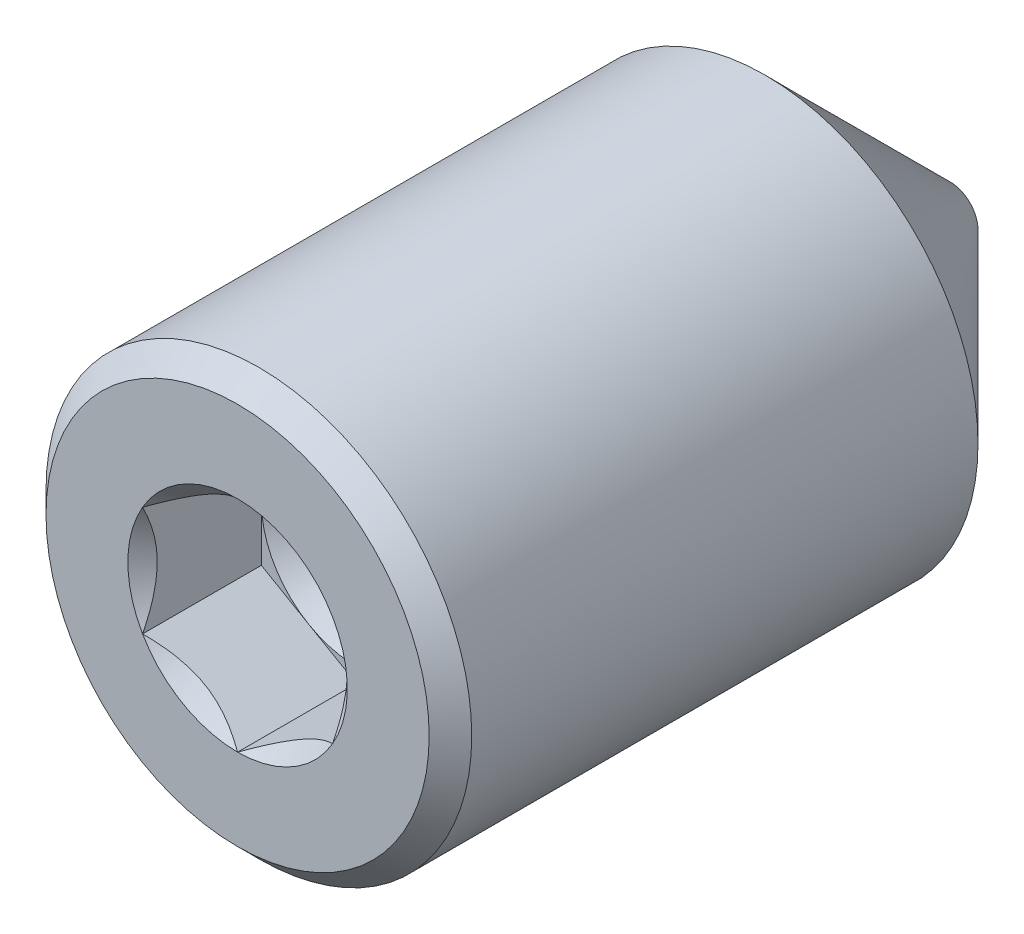
ISO-10303-21;
HEADER;
FILE_DESCRIPTION(('STEP AP214'),'2;1');
FILE_NAME('part.step','',(''),(''),'','','');
FILE_SCHEMA(('AUTOMOTIVE_DESIGN { 1 0 10303 214 1 1 1 1 }'));
ENDSEC;
DATA;
#1=APPLICATION_CONTEXT('core data for automotive mechanical design processes');
#2=APPLICATION_PROTOCOL_DEFINITION('international standard','automotive_design',2000,#1);
#3=PRODUCT_CONTEXT('',#1,'mechanical');
#4=PRODUCT('Part','Part','',(#3));
#5=PRODUCT_RELATED_PRODUCT_CATEGORY('part','',(#4));
#6=PRODUCT_DEFINITION_FORMATION('','',#4);
#7=PRODUCT_DEFINITION_CONTEXT('part definition',#1,'design');
#8=PRODUCT_DEFINITION('design','',#6,#7);
#9=PRODUCT_DEFINITION_SHAPE('','',#8);
#10=(LENGTH_UNIT() NAMED_UNIT(*) SI_UNIT(.MILLI.,.METRE.));
#11=(NAMED_UNIT(*) PLANE_ANGLE_UNIT() SI_UNIT($,.RADIAN.));
#12=(NAMED_UNIT(*) SI_UNIT($,.STERADIAN.) SOLID_ANGLE_UNIT());
#13=UNCERTAINTY_MEASURE_WITH_UNIT(LENGTH_MEASURE(1.E-05),#10,'distance_accuracy_value','');
#14=(GEOMETRIC_REPRESENTATION_CONTEXT(3) GLOBAL_UNCERTAINTY_ASSIGNED_CONTEXT((#13)) GLOBAL_UNIT_ASSIGNED_CONTEXT((#10,
#11,#12)) REPRESENTATION_CONTEXT('',''));
#15=CARTESIAN_POINT('',(0.,0.,0.));
#16=DIRECTION('',(0.,0.,1.));
#17=DIRECTION('',(1.,0.,0.));
#18=AXIS2_PLACEMENT_3D('',#15,#16,#17);
#19=CARTESIAN_POINT('',(0.,0.,1.5875));
#20=DIRECTION('',(0.,0.,1.));
#21=DIRECTION('',(1.,0.,0.));
#22=AXIS2_PLACEMENT_3D('',#19,#20,#21);
#23=PLANE('',#22);
#24=CARTESIAN_POINT('',(0.,0.,1.5875));
#25=DIRECTION('',(0.,0.,1.));
#26=DIRECTION('',(1.,0.,0.));
#27=AXIS2_PLACEMENT_3D('',#24,#25,#26);
#28=CIRCLE('',#27,0.635000000000001);
#29=CARTESIAN_POINT('',(0.634999999999999,0.,1.5875));
#30=VERTEX_POINT('',#29);
#31=CARTESIAN_POINT('',(0.317500000000001,0.54992613140312,1.5875));
#32=VERTEX_POINT('',#31);
#33=EDGE_CURVE('E128',#30,#32,#28,.T.);
#34=ORIENTED_EDGE('',*,*,#33,.F.);
#35=DIRECTION('',(0.,1.,0.));
#36=VECTOR('',#35,1.);
#37=CARTESIAN_POINT('',(0.634999999999999,-0.366617420935412,1.5875));
#38=LINE('',#37,#36);
#39=CARTESIAN_POINT('',(0.634999999999999,0.366617420935415,1.5875));
#40=VERTEX_POINT('',#39);
#41=EDGE_CURVE('E160',#30,#40,#38,.T.);
#42=ORIENTED_EDGE('',*,*,#41,.T.);
#43=DIRECTION('',(-0.866025403784439,0.5,0.));
#44=VECTOR('',#43,1.);
#45=CARTESIAN_POINT('',(0.634999999999999,0.366617420935415,1.5875));
#46=LINE('',#45,#44);
#47=EDGE_CURVE('E153',#40,#32,#46,.T.);
#48=ORIENTED_EDGE('',*,*,#47,.T.);
#49=EDGE_LOOP('',(#34,#42,#48));
#50=FACE_BOUND('',#49,.T.);
#51=ADVANCED_FACE('F43',(#50),#23,.T.);
#52=CARTESIAN_POINT('',(-0.3175,0.54992613140312,1.5875));
#53=VERTEX_POINT('',#52);
#54=EDGE_CURVE('E130',#32,#53,#28,.T.);
#55=ORIENTED_EDGE('',*,*,#54,.F.);
#56=CARTESIAN_POINT('',(0.,0.733234841870826,1.5875));
#57=VERTEX_POINT('',#56);
#58=EDGE_CURVE('E143',#32,#57,#46,.T.);
#59=ORIENTED_EDGE('',*,*,#58,.T.);
#60=DIRECTION('',(-0.86602540378444,-0.499999999999998,0.));
#61=VECTOR('',#60,1.);
#62=CARTESIAN_POINT('',(0.,0.733234841870826,1.5875));
#63=LINE('',#62,#61);
#64=EDGE_CURVE('E146',#57,#53,#63,.T.);
#65=ORIENTED_EDGE('',*,*,#64,.T.);
#66=EDGE_LOOP('',(#55,#59,#65));
#67=FACE_BOUND('',#66,.T.);
#68=ADVANCED_FACE('F142',(#67),#23,.T.);
#69=CARTESIAN_POINT('',(-0.634999999999999,0.,1.5875));
#70=VERTEX_POINT('',#69);
#71=EDGE_CURVE('E148',#53,#70,#28,.T.);
#72=ORIENTED_EDGE('',*,*,#71,.F.);
#73=CARTESIAN_POINT('',(-0.634999999999999,0.366617420935415,1.5875));
#74=VERTEX_POINT('',#73);
#75=EDGE_CURVE('E163',#53,#74,#63,.T.);
#76=ORIENTED_EDGE('',*,*,#75,.T.);
#77=DIRECTION('',(0.,-1.,0.));
#78=VECTOR('',#77,1.);
#79=CARTESIAN_POINT('',(-0.634999999999999,0.366617420935415,1.5875));
#80=LINE('',#79,#78);
#81=EDGE_CURVE('E171',#74,#70,#80,.T.);
#82=ORIENTED_EDGE('',*,*,#81,.T.);
#83=EDGE_LOOP('',(#72,#76,#82));
#84=FACE_BOUND('',#83,.T.);
#85=ADVANCED_FACE('F238',(#84),#23,.T.);
#86=CARTESIAN_POINT('',(-0.3175,-0.549926131403119,1.5875));
#87=VERTEX_POINT('',#86);
#88=EDGE_CURVE('E373',#70,#87,#28,.T.);
#89=ORIENTED_EDGE('',*,*,#88,.F.);
#90=CARTESIAN_POINT('',(-0.634999999999999,-0.366617420935413,1.5875));
#91=VERTEX_POINT('',#90);
#92=EDGE_CURVE('E170',#70,#91,#80,.T.);
#93=ORIENTED_EDGE('',*,*,#92,.T.);
#94=DIRECTION('',(0.866025403784439,-0.5,0.));
#95=VECTOR('',#94,1.);
#96=CARTESIAN_POINT('',(-0.634999999999999,-0.366617420935413,1.5875));
#97=LINE('',#96,#95);
#98=EDGE_CURVE('E262',#91,#87,#97,.T.);
#99=ORIENTED_EDGE('',*,*,#98,.T.);
#100=EDGE_LOOP('',(#89,#93,#99));
#101=FACE_BOUND('',#100,.T.);
#102=ADVANCED_FACE('F230',(#101),#23,.T.);
#103=CARTESIAN_POINT('',(0.3175,-0.549926131403118,1.5875));
#104=VERTEX_POINT('',#103);
#105=EDGE_CURVE('E65',#87,#104,#28,.T.);
#106=ORIENTED_EDGE('',*,*,#105,.F.);
#107=CARTESIAN_POINT('',(0.,-0.733234841870825,1.5875));
#108=VERTEX_POINT('',#107);
#109=EDGE_CURVE('E264',#87,#108,#97,.T.);
#110=ORIENTED_EDGE('',*,*,#109,.T.);
#111=DIRECTION('',(0.866025403784438,0.5,0.));
#112=VECTOR('',#111,1.);
#113=CARTESIAN_POINT('',(0.,-0.733234841870825,1.5875));
#114=LINE('',#113,#112);
#115=EDGE_CURVE('E260',#108,#104,#114,.T.);
#116=ORIENTED_EDGE('',*,*,#115,.T.);
#117=EDGE_LOOP('',(#106,#110,#116));
#118=FACE_BOUND('',#117,.T.);
#119=ADVANCED_FACE('F221',(#118),#23,.T.);
#120=CARTESIAN_POINT('',(0.,1.4224,2.38125));
#121=DIRECTION('',(0.,0.,-1.));
#122=DIRECTION('',(-1.,0.,0.));
#123=AXIS2_PLACEMENT_3D('',#120,#121,#122);
#124=PLANE('',#123);
#125=CARTESIAN_POINT('',(0.,0.,2.38125));
#126=DIRECTION('',(0.,0.,1.));
#127=DIRECTION('',(1.,0.,0.));
#128=AXIS2_PLACEMENT_3D('',#125,#126,#127);
#129=CIRCLE('',#128,0.733234841870826);
#130=CARTESIAN_POINT('',(-0.634999999999999,0.366617420935415,2.38125));
#131=VERTEX_POINT('',#130);
#132=CARTESIAN_POINT('',(-0.634999999999999,-0.366617420935416,2.38125));
#133=VERTEX_POINT('',#132);
#134=EDGE_CURVE('E72',#131,#133,#129,.T.);
#135=ORIENTED_EDGE('',*,*,#134,.F.);
#136=CARTESIAN_POINT('',(0.,0.733234841870826,2.38125));
#137=VERTEX_POINT('',#136);
#138=EDGE_CURVE('E347',#137,#131,#129,.T.);
#139=ORIENTED_EDGE('',*,*,#138,.F.);
#140=CARTESIAN_POINT('',(0.634999999999999,0.366617420935416,2.38125));
#141=VERTEX_POINT('',#140);
#142=EDGE_CURVE('E340',#141,#137,#129,.T.);
#143=ORIENTED_EDGE('',*,*,#142,.F.);
#144=CARTESIAN_POINT('',(0.635000000000002,-0.366617420935411,2.38125));
#145=VERTEX_POINT('',#144);
#146=EDGE_CURVE('E137',#145,#141,#129,.T.);
#147=ORIENTED_EDGE('',*,*,#146,.F.);
#148=CARTESIAN_POINT('',(0.,-0.733234841870826,2.38125));
#149=VERTEX_POINT('',#148);
#150=EDGE_CURVE('E338',#149,#145,#129,.T.);
#151=ORIENTED_EDGE('',*,*,#150,.F.);
#152=EDGE_CURVE('E345',#133,#149,#129,.T.);
#153=ORIENTED_EDGE('',*,*,#152,.F.);
#154=EDGE_LOOP('',(#135,#139,#143,#147,#151,#153));
#155=FACE_BOUND('',#154,.T.);
#156=CARTESIAN_POINT('',(0.,0.,2.38125));
#157=DIRECTION('',(0.,0.,-1.));
#158=DIRECTION('',(-1.,0.,0.));
#159=AXIS2_PLACEMENT_3D('',#156,#157,#158);
#160=CIRCLE('',#159,1.28016);
#161=CARTESIAN_POINT('',(-1.28016,0.,2.38125));
#162=VERTEX_POINT('',#161);
#163=EDGE_CURVE('E203',#162,#162,#160,.F.);
#164=ORIENTED_EDGE('',*,*,#163,.T.);
#165=EDGE_LOOP('',(#164));
#166=FACE_BOUND('',#165,.T.);
#167=ADVANCED_FACE('F218',(#155,#166),#124,.F.);
#168=CARTESIAN_POINT('',(0.,0.,-2.38125));
#169=DIRECTION('',(0.,0.,1.));
#170=DIRECTION('',(1.,0.,0.));
#171=AXIS2_PLACEMENT_3D('',#168,#169,#170);
#172=PLANE('',#171);
#173=CARTESIAN_POINT('',(0.,0.,-2.38125));
#174=DIRECTION('',(0.,0.,1.));
#175=DIRECTION('',(1.,0.,0.));
#176=AXIS2_PLACEMENT_3D('',#173,#174,#175);
#177=CIRCLE('',#176,0.184912);
#178=CARTESIAN_POINT('',(0.184912,0.,-2.38125));
#179=VERTEX_POINT('',#178);
#180=EDGE_CURVE('E199',#179,#179,#177,.T.);
#181=ORIENTED_EDGE('',*,*,#180,.F.);
#182=EDGE_LOOP('',(#181));
#183=FACE_BOUND('',#182,.T.);
#184=ADVANCED_FACE('F220',(#183),#172,.F.);
#185=CARTESIAN_POINT('',(0.,0.,-2.38125));
#186=DIRECTION('',(0.,0.,1.));
#187=DIRECTION('',(1.,0.,0.));
#188=AXIS2_PLACEMENT_3D('',#185,#186,#187);
#189=CONICAL_SURFACE('',#188,0.184912,0.78539816339745);
#190=CARTESIAN_POINT('',(0.,0.,-1.143762));
#191=DIRECTION('',(0.,0.,1.));
#192=DIRECTION('',(1.,0.,0.));
#193=AXIS2_PLACEMENT_3D('',#190,#191,#192);
#194=CIRCLE('',#193,1.4224);
#195=CARTESIAN_POINT('',(1.4224,0.,-1.143762));
#196=VERTEX_POINT('',#195);
#197=EDGE_CURVE('E180',#196,#196,#194,.T.);
#198=CARTESIAN_POINT('',(1.4224,0.,-1.143762));
#199=CARTESIAN_POINT('',(1.4095095,0.,-1.1566525));
#200=CARTESIAN_POINT('',(1.396619,0.,-1.169543));
#201=CARTESIAN_POINT('',(1.370838,0.,-1.195324));
#202=CARTESIAN_POINT('',(1.3579475,0.,-1.2082145));
#203=CARTESIAN_POINT('',(1.3321665,0.,-1.2339955));
#204=CARTESIAN_POINT('',(1.319276,0.,-1.246886));
#205=CARTESIAN_POINT('',(1.293495,0.,-1.272667));
#206=CARTESIAN_POINT('',(1.2806045,0.,-1.2855575));
#207=CARTESIAN_POINT('',(1.2548235,0.,-1.3113385));
#208=CARTESIAN_POINT('',(1.241933,0.,-1.324229));
#209=CARTESIAN_POINT('',(1.216152,0.,-1.35001));
#210=CARTESIAN_POINT('',(1.2032615,0.,-1.3629005));
#211=CARTESIAN_POINT('',(1.1774805,0.,-1.3886815));
#212=CARTESIAN_POINT('',(1.16459,0.,-1.401572));
#213=CARTESIAN_POINT('',(1.138809,0.,-1.427353));
#214=CARTESIAN_POINT('',(1.1259185,0.,-1.4402435));
#215=CARTESIAN_POINT('',(1.1001375,0.,-1.4660245));
#216=CARTESIAN_POINT('',(1.087247,0.,-1.478915));
#217=CARTESIAN_POINT('',(1.061466,0.,-1.504696));
#218=CARTESIAN_POINT('',(1.0485755,0.,-1.5175865));
#219=CARTESIAN_POINT('',(1.0227945,0.,-1.5433675));
#220=CARTESIAN_POINT('',(1.009904,0.,-1.556258));
#221=CARTESIAN_POINT('',(0.984122999999999,0.,-1.582039));
#222=CARTESIAN_POINT('',(0.971232499999999,0.,-1.5949295));
#223=CARTESIAN_POINT('',(0.945451499999999,0.,-1.6207105));
#224=CARTESIAN_POINT('',(0.932560999999999,0.,-1.633601));
#225=CARTESIAN_POINT('',(0.906779999999999,0.,-1.659382));
#226=CARTESIAN_POINT('',(0.893889499999999,0.,-1.6722725));
#227=CARTESIAN_POINT('',(0.868108499999999,0.,-1.6980535));
#228=CARTESIAN_POINT('',(0.855217999999999,0.,-1.710944));
#229=CARTESIAN_POINT('',(0.829436999999999,0.,-1.736725));
#230=CARTESIAN_POINT('',(0.816546499999999,0.,-1.7496155));
#231=CARTESIAN_POINT('',(0.790765499999999,0.,-1.7753965));
#232=CARTESIAN_POINT('',(0.777874999999999,0.,-1.788287));
#233=CARTESIAN_POINT('',(0.752093999999999,0.,-1.814068));
#234=CARTESIAN_POINT('',(0.739203499999999,0.,-1.8269585));
#235=CARTESIAN_POINT('',(0.713422499999999,0.,-1.8527395));
#236=CARTESIAN_POINT('',(0.700531999999999,0.,-1.86563));
#237=CARTESIAN_POINT('',(0.674750999999999,0.,-1.891411));
#238=CARTESIAN_POINT('',(0.661860499999999,0.,-1.9043015));
#239=CARTESIAN_POINT('',(0.636079499999999,0.,-1.9300825));
#240=CARTESIAN_POINT('',(0.623188999999999,0.,-1.942973));
#241=CARTESIAN_POINT('',(0.597407999999999,0.,-1.968754));
#242=CARTESIAN_POINT('',(0.584517499999999,0.,-1.9816445));
#243=CARTESIAN_POINT('',(0.5587365,0.,-2.0074255));
#244=CARTESIAN_POINT('',(0.545846,0.,-2.020316));
#245=CARTESIAN_POINT('',(0.520064999999999,0.,-2.046097));
#246=CARTESIAN_POINT('',(0.507174499999999,0.,-2.0589875));
#247=CARTESIAN_POINT('',(0.481393499999999,0.,-2.0847685));
#248=CARTESIAN_POINT('',(0.468502999999999,0.,-2.097659));
#249=CARTESIAN_POINT('',(0.442722,0.,-2.12344));
#250=CARTESIAN_POINT('',(0.429831499999999,0.,-2.1363305));
#251=CARTESIAN_POINT('',(0.404050499999999,0.,-2.1621115));
#252=CARTESIAN_POINT('',(0.39116,0.,-2.175002));
#253=CARTESIAN_POINT('',(0.365379,0.,-2.200783));
#254=CARTESIAN_POINT('',(0.352488499999999,0.,-2.2136735));
#255=CARTESIAN_POINT('',(0.326707499999999,0.,-2.2394545));
#256=CARTESIAN_POINT('',(0.313817,0.,-2.252345));
#257=CARTESIAN_POINT('',(0.288036,0.,-2.278126));
#258=CARTESIAN_POINT('',(0.2751455,0.,-2.2910165));
#259=CARTESIAN_POINT('',(0.2493645,0.,-2.3167975));
#260=CARTESIAN_POINT('',(0.236474,0.,-2.329688));
#261=CARTESIAN_POINT('',(0.210693,0.,-2.355469));
#262=CARTESIAN_POINT('',(0.1978025,0.,-2.3683595));
#263=CARTESIAN_POINT('',(0.184912,0.,-2.38125));
#264=B_SPLINE_CURVE_WITH_KNOTS('',3,(#198,#199,#200,#201,#202,#203,#204,#205,#206,#207,#208,
#209,#210,#211,#212,#213,#214,#215,#216,#217,#218,#219,#220,#221,#222,#223,#224,#225,#226,#227,
#228,#229,#230,#231,#232,#233,#234,#235,#236,#237,#238,#239,#240,#241,#242,#243,#244,#245,#246,
#247,#248,#249,#250,#251,#252,#253,#254,#255,#256,#257,#258,#259,#260,#261,#262,#263),
.UNSPECIFIED.,.F.,.F.,(4,2,2,2,2,2,2,2,2,2,2,2,2,2,2,2,2,2,2,2,2,2,2,2,2,2,2,2,2,2,2,2,4),(0.,
0.0546897597773109,0.109379519554622,0.164069279331933,0.218759039109244,0.273448798886555,
0.328138558663866,0.382828318441177,0.437518078218488,0.492207837995799,0.54689759777311,
0.601587357550421,0.656277117327732,0.710966877105043,0.765656636882354,0.820346396659665,
0.875036156436976,0.929725916214287,0.984415675991598,1.03910543576891,1.09379519554622,
1.14848495532353,1.20317471510084,1.25786447487815,1.31255423465546,1.36724399443278,
1.42193375421009,1.4766235139874,1.53131327376471,1.58600303354202,1.64069279331933,
1.69538255309664,1.75007231287395),.UNSPECIFIED.);
#265=EDGE_CURVE('BSEAM227',#196,#179,#264,.T.);
#266=ORIENTED_EDGE('',*,*,#197,.F.);
#267=ORIENTED_EDGE('',*,*,#180,.T.);
#268=ORIENTED_EDGE('',*,*,#265,.T.);
#269=ORIENTED_EDGE('',*,*,#265,.F.);
#270=EDGE_LOOP('',(#266,#268,#267,#269));
#271=FACE_BOUND('',#270,.T.);
#272=ADVANCED_FACE('F227',(#271),#189,.T.);
#273=CARTESIAN_POINT('',(0.,0.,2.38125));
#274=DIRECTION('',(0.,0.,1.));
#275=DIRECTION('',(1.,0.,0.));
#276=AXIS2_PLACEMENT_3D('',#273,#274,#275);
#277=CYLINDRICAL_SURFACE('',#276,1.4224);
#278=CARTESIAN_POINT('',(0.,0.,2.23901));
#279=DIRECTION('',(0.,0.,-1.));
#280=DIRECTION('',(-1.,0.,0.));
#281=AXIS2_PLACEMENT_3D('',#278,#279,#280);
#282=CIRCLE('',#281,1.4224);
#283=CARTESIAN_POINT('',(-1.4224,0.,2.23901));
#284=VERTEX_POINT('',#283);
#285=EDGE_CURVE('E58',#284,#284,#282,.T.);
#286=ORIENTED_EDGE('',*,*,#285,.T.);
#287=EDGE_LOOP('',(#286));
#288=FACE_BOUND('',#287,.T.);
#289=ORIENTED_EDGE('',*,*,#197,.T.);
#290=EDGE_LOOP('',(#289));
#291=FACE_BOUND('',#290,.T.);
#292=ADVANCED_FACE('F210',(#288,#291),#277,.T.);
#293=CARTESIAN_POINT('',(0.,0.,2.38125));
#294=DIRECTION('',(0.,0.,-1.));
#295=DIRECTION('',(-1.,0.,0.));
#296=AXIS2_PLACEMENT_3D('',#293,#294,#295);
#297=CONICAL_SURFACE('',#296,1.28016,0.785398163397448);
#298=ORIENTED_EDGE('',*,*,#285,.F.);
#299=EDGE_LOOP('',(#298));
#300=FACE_BOUND('',#299,.T.);
#301=ORIENTED_EDGE('',*,*,#163,.F.);
#302=EDGE_LOOP('',(#301));
#303=FACE_BOUND('',#302,.T.);
#304=ADVANCED_FACE('F45',(#300,#303),#297,.T.);
#305=CARTESIAN_POINT('',(0.,0.,2.38125));
#306=DIRECTION('',(0.,0.,1.));
#307=DIRECTION('',(1.,0.,0.));
#308=AXIS2_PLACEMENT_3D('',#305,#306,#307);
#309=CONICAL_SURFACE('',#308,0.733234841870826,0.78539816339745);
#310=ORIENTED_EDGE('',*,*,#150,.T.);
#311=CARTESIAN_POINT('',(-0.000200000000000102,-0.733350311924663,2.38136549732593));
#312=CARTESIAN_POINT('',(0.0216382953156779,-0.720741966245514,2.36876471523145));
#313=CARTESIAN_POINT('',(0.0438403745570412,-0.707923589818943,2.35690242075504));
#314=CARTESIAN_POINT('',(0.0891134104790393,-0.681785190342346,2.33518202089685));
#315=CARTESIAN_POINT('',(0.112188680945241,-0.668462676727061,2.32533601315109));
#316=CARTESIAN_POINT('',(0.158721911288256,-0.641596703662258,2.30847150279478));
#317=CARTESIAN_POINT('',(0.182167952487112,-0.628060125464668,2.30141053144256));
#318=CARTESIAN_POINT('',(0.229565059822435,-0.60069539278581,2.29052263650265));
#319=CARTESIAN_POINT('',(0.253514703467398,-0.586868059580394,2.28668760314623));
#320=CARTESIAN_POINT('',(0.312013188787161,-0.553093943333844,2.28182213495313));
#321=CARTESIAN_POINT('',(0.346698667719925,-0.533068272735041,2.28270233088706));
#322=CARTESIAN_POINT('',(0.415342587019972,-0.493436687448928,2.29177206408745));
#323=CARTESIAN_POINT('',(0.449299864102858,-0.473831444384177,2.29997251663846));
#324=CARTESIAN_POINT('',(0.508936458936855,-0.439400240303216,2.31974854218865));
#325=CARTESIAN_POINT('',(0.534889912662094,-0.424416006808549,2.33029263333793));
#326=CARTESIAN_POINT('',(0.585779870462626,-0.395034675973363,2.35404604870667));
#327=CARTESIAN_POINT('',(0.610719373212326,-0.380635847347369,2.36724670343896));
#328=CARTESIAN_POINT('',(0.635199999999999,-0.366501950881575,2.38136549732593));
#329=B_SPLINE_CURVE_WITH_KNOTS('',3,(#311,#312,#313,#314,#315,#316,#317,#318,#319,#320,#321,
#322,#323,#324,#325,#326,#327,#328),.UNSPECIFIED.,.F.,.F.,(4,2,2,2,2,2,2,2,4),(0.,
0.0846259124083199,0.169745589939071,0.253511844988299,0.337066883146092,0.456489711576423,
0.576090910203463,0.671263448299218,0.76613029304668),.UNSPECIFIED.);
#330=EDGE_CURVE('E11',#149,#145,#329,.T.);
#331=ORIENTED_EDGE('',*,*,#330,.F.);
#332=EDGE_LOOP('',(#310,#331));
#333=FACE_BOUND('',#332,.T.);
#334=ADVANCED_FACE('F215',(#333),#309,.F.);
#335=ORIENTED_EDGE('',*,*,#146,.T.);
#336=CARTESIAN_POINT('',(0.634999999999999,-0.731184774905032,2.6164449052213));
#337=CARTESIAN_POINT('',(0.634999999999999,-0.695560510635467,2.58960843318131));
#338=CARTESIAN_POINT('',(0.634999999999999,-0.65955949454243,2.56321676788828));
#339=CARTESIAN_POINT('',(0.634999999999999,-0.58618430998853,2.51179559409201));
#340=CARTESIAN_POINT('',(0.634999999999999,-0.548801623395418,2.48677831137227));
#341=CARTESIAN_POINT('',(0.634999999999999,-0.470413352958487,2.43765509006025));
#342=CARTESIAN_POINT('',(0.634999999999999,-0.429322770893479,2.41368267599417));
#343=CARTESIAN_POINT('',(0.634999999999999,-0.345090964349352,2.3698343213979));
#344=CARTESIAN_POINT('',(0.634999999999999,-0.301957281434777,2.34994457081665));
#345=CARTESIAN_POINT('',(0.634999999999999,-0.237206748479471,2.32561298918661));
#346=CARTESIAN_POINT('',(0.634999999999999,-0.216551949441191,2.31862994139745));
#347=CARTESIAN_POINT('',(0.634999999999999,-0.174754779429724,2.30631758646518));
#348=CARTESIAN_POINT('',(0.634999999999999,-0.153612374975028,2.30098839324967));
#349=CARTESIAN_POINT('',(0.634999999999999,-0.0903392283049218,2.28811090149537));
#350=CARTESIAN_POINT('',(0.634999999999999,-0.0475748058684262,2.28335601608245));
#351=CARTESIAN_POINT('',(0.634999999999999,0.0364716243291507,2.28272192409468));
#352=CARTESIAN_POINT('',(0.634999999999999,0.077751297067312,2.28652786995088));
#353=CARTESIAN_POINT('',(0.634999999999999,0.138948326892628,2.2977155796225));
#354=CARTESIAN_POINT('',(0.634999999999999,0.159409283049329,2.30242653583126));
#355=CARTESIAN_POINT('',(0.634999999999999,0.199893323210749,2.31345163610963));
#356=CARTESIAN_POINT('',(0.634999999999999,0.21991644370174,2.31976564603429));
#357=CARTESIAN_POINT('',(0.634999999999999,0.282954568585315,2.3420207669286));
#358=CARTESIAN_POINT('',(0.634999999999999,0.32506940210101,2.36049746255418));
#359=CARTESIAN_POINT('',(0.634999999999999,0.407322059089851,2.4015810215375));
#360=CARTESIAN_POINT('',(0.634999999999999,0.447452099887751,2.42420272349413));
#361=CARTESIAN_POINT('',(0.634999999999999,0.52414778940185,2.47085987110921));
#362=CARTESIAN_POINT('',(0.634999999999999,0.560791466616129,2.49476920217037));
#363=CARTESIAN_POINT('',(0.634999999999999,0.632664852451176,2.54402829933761));
#364=CARTESIAN_POINT('',(0.634999999999999,0.667903672431243,2.56936468957093));
#365=CARTESIAN_POINT('',(0.634999999999999,0.702755676949191,2.59516379561133));
#366=B_SPLINE_CURVE_WITH_KNOTS('',3,(#336,#337,#338,#339,#340,#341,#342,#343,#344,#345,#346,
#347,#348,#349,#350,#351,#352,#353,#354,#355,#356,#357,#358,#359,#360,#361,#362,#363,#364,#365),
.UNSPECIFIED.,.F.,.F.,(4,2,2,2,2,2,2,2,2,2,2,2,2,2,4),(0.,0.13385216777859,0.268748027168033,
0.411343582300861,0.553448541187978,0.618797785929163,0.684151531326689,0.812345657019689,
0.93590247627937,0.998834470169292,1.06176119958964,1.19932956824188,1.33740039345849,
1.46861008284853,1.59874695816139),.UNSPECIFIED.);
#367=EDGE_CURVE('E295',#145,#141,#366,.T.);
#368=ORIENTED_EDGE('',*,*,#367,.F.);
#369=EDGE_LOOP('',(#335,#368));
#370=FACE_BOUND('',#369,.T.);
#371=ADVANCED_FACE('F430',(#370),#309,.F.);
#372=ORIENTED_EDGE('',*,*,#142,.T.);
#373=CARTESIAN_POINT('',(0.635199999999999,0.366501950881577,2.38136549732593));
#374=CARTESIAN_POINT('',(0.613361704684321,0.379110296560726,2.36876471523145));
#375=CARTESIAN_POINT('',(0.591159625442958,0.391928672987296,2.35690242075504));
#376=CARTESIAN_POINT('',(0.54588658952096,0.418067072463893,2.33518202089685));
#377=CARTESIAN_POINT('',(0.522811319054759,0.431389586079178,2.32533601315109));
#378=CARTESIAN_POINT('',(0.476278088711744,0.458255559143981,2.30847150279478));
#379=CARTESIAN_POINT('',(0.452832047512888,0.471792137341571,2.30141053144256));
#380=CARTESIAN_POINT('',(0.405434940177565,0.499156870020429,2.29052263650265));
#381=CARTESIAN_POINT('',(0.381485296532602,0.512984203225845,2.28668760314623));
#382=CARTESIAN_POINT('',(0.322986811212839,0.546758319472395,2.28182213495313));
#383=CARTESIAN_POINT('',(0.288301332280075,0.566783990071197,2.28270233088706));
#384=CARTESIAN_POINT('',(0.219657412980027,0.606415575357311,2.29177206408745));
#385=CARTESIAN_POINT('',(0.185700135897142,0.626020818422061,2.29997251663846));
#386=CARTESIAN_POINT('',(0.126063541063145,0.660452022503022,2.31974854218865));
#387=CARTESIAN_POINT('',(0.100110087337906,0.67543625599769,2.33029263333793));
#388=CARTESIAN_POINT('',(0.0492201295373734,0.704817586832876,2.35404604870667));
#389=CARTESIAN_POINT('',(0.024280626787674,0.71921641545887,2.36724670343896));
#390=CARTESIAN_POINT('',(-0.000199999999999248,0.733350311924664,2.38136549732593));
#391=B_SPLINE_CURVE_WITH_KNOTS('',3,(#373,#374,#375,#376,#377,#378,#379,#380,#381,#382,#383,
#384,#385,#386,#387,#388,#389,#390),.UNSPECIFIED.,.F.,.F.,(4,2,2,2,2,2,2,2,4),(0.,
0.0846259124083197,0.169745589939071,0.253511844988298,0.337066883146091,0.456489711576421,
0.576090910203462,0.671263448299217,0.766130293046679),.UNSPECIFIED.);
#392=EDGE_CURVE('E304',#141,#137,#391,.T.);
#393=ORIENTED_EDGE('',*,*,#392,.F.);
#394=EDGE_LOOP('',(#372,#393));
#395=FACE_BOUND('',#394,.T.);
#396=ADVANCED_FACE('F421',(#395),#309,.F.);
#397=ORIENTED_EDGE('',*,*,#138,.T.);
#398=CARTESIAN_POINT('',(0.000200000000000754,0.733350311924664,2.38136549732593));
#399=CARTESIAN_POINT('',(-0.0216382953156771,0.720741966245515,2.36876471523145));
#400=CARTESIAN_POINT('',(-0.0438403745570405,0.707923589818944,2.35690242075504));
#401=CARTESIAN_POINT('',(-0.0891134104790388,0.681785190342347,2.33518202089685));
#402=CARTESIAN_POINT('',(-0.11218868094524,0.668462676727062,2.32533601315109));
#403=CARTESIAN_POINT('',(-0.158721911288255,0.64159670366226,2.30847150279478));
#404=CARTESIAN_POINT('',(-0.182167952487111,0.628060125464669,2.30141053144256));
#405=CARTESIAN_POINT('',(-0.229565059822434,0.600695392785811,2.29052263650265));
#406=CARTESIAN_POINT('',(-0.253514703467398,0.586868059580396,2.28668760314623));
#407=CARTESIAN_POINT('',(-0.31201318878716,0.553093943333846,2.28182213495313));
#408=CARTESIAN_POINT('',(-0.346698667719925,0.533068272735043,2.28270233088706));
#409=CARTESIAN_POINT('',(-0.415342587019972,0.49343668744893,2.29177206408745));
#410=CARTESIAN_POINT('',(-0.449299864102858,0.473831444384179,2.29997251663846));
#411=CARTESIAN_POINT('',(-0.508936458936855,0.439400240303218,2.31974854218865));
#412=CARTESIAN_POINT('',(-0.534889912662094,0.424416006808551,2.33029263333793));
#413=CARTESIAN_POINT('',(-0.585779870462627,0.395034675973365,2.35404604870667));
#414=CARTESIAN_POINT('',(-0.610719373212326,0.380635847347371,2.36724670343896));
#415=CARTESIAN_POINT('',(-0.635199999999999,0.366501950881577,2.38136549732593));
#416=B_SPLINE_CURVE_WITH_KNOTS('',3,(#398,#399,#400,#401,#402,#403,#404,#405,#406,#407,#408,
#409,#410,#411,#412,#413,#414,#415),.UNSPECIFIED.,.F.,.F.,(4,2,2,2,2,2,2,2,4),(0.,
0.08462591240832,0.169745589939071,0.253511844988299,0.337066883146092,0.456489711576422,
0.576090910203463,0.671263448299218,0.76613029304668),.UNSPECIFIED.);
#417=EDGE_CURVE('E310',#137,#131,#416,.T.);
#418=ORIENTED_EDGE('',*,*,#417,.F.);
#419=EDGE_LOOP('',(#397,#418));
#420=FACE_BOUND('',#419,.T.);
#421=ADVANCED_FACE('F412',(#420),#309,.F.);
#422=ORIENTED_EDGE('',*,*,#134,.T.);
#423=CARTESIAN_POINT('',(-0.634999999999999,-0.731184774905033,2.6164449052213));
#424=CARTESIAN_POINT('',(-0.634999999999999,-0.695560510635467,2.58960843318131));
#425=CARTESIAN_POINT('',(-0.634999999999999,-0.65955949454243,2.56321676788828));
#426=CARTESIAN_POINT('',(-0.634999999999999,-0.58618430998853,2.51179559409201));
#427=CARTESIAN_POINT('',(-0.634999999999999,-0.548801623395418,2.48677831137227));
#428=CARTESIAN_POINT('',(-0.634999999999999,-0.470413352958487,2.43765509006025));
#429=CARTESIAN_POINT('',(-0.634999999999999,-0.429322770893479,2.41368267599417));
#430=CARTESIAN_POINT('',(-0.634999999999999,-0.345090964349352,2.3698343213979));
#431=CARTESIAN_POINT('',(-0.634999999999999,-0.301957281434777,2.34994457081665));
#432=CARTESIAN_POINT('',(-0.634999999999999,-0.237206748479472,2.32561298918661));
#433=CARTESIAN_POINT('',(-0.634999999999999,-0.216551949441191,2.31862994139745));
#434=CARTESIAN_POINT('',(-0.634999999999999,-0.174754779429724,2.30631758646518));
#435=CARTESIAN_POINT('',(-0.634999999999999,-0.153612374975028,2.30098839324967));
#436=CARTESIAN_POINT('',(-0.634999999999999,-0.0903392283049219,2.28811090149537));
#437=CARTESIAN_POINT('',(-0.634999999999999,-0.0475748058684263,2.28335601608245));
#438=CARTESIAN_POINT('',(-0.634999999999999,0.0364716243291506,2.28272192409468));
#439=CARTESIAN_POINT('',(-0.634999999999999,0.077751297067312,2.28652786995088));
#440=CARTESIAN_POINT('',(-0.634999999999999,0.138948326892628,2.2977155796225));
#441=CARTESIAN_POINT('',(-0.634999999999999,0.159409283049329,2.30242653583126));
#442=CARTESIAN_POINT('',(-0.634999999999999,0.199893323210749,2.31345163610963));
#443=CARTESIAN_POINT('',(-0.634999999999999,0.21991644370174,2.31976564603429));
#444=CARTESIAN_POINT('',(-0.634999999999999,0.282954568585315,2.3420207669286));
#445=CARTESIAN_POINT('',(-0.634999999999999,0.32506940210101,2.36049746255418));
#446=CARTESIAN_POINT('',(-0.634999999999999,0.40732205908985,2.4015810215375));
#447=CARTESIAN_POINT('',(-0.634999999999999,0.447452099887751,2.42420272349413));
#448=CARTESIAN_POINT('',(-0.634999999999999,0.52414778940185,2.47085987110921));
#449=CARTESIAN_POINT('',(-0.634999999999999,0.560791466616129,2.49476920217037));
#450=CARTESIAN_POINT('',(-0.634999999999999,0.632664852451176,2.54402829933761));
#451=CARTESIAN_POINT('',(-0.634999999999999,0.667903672431243,2.56936468957093));
#452=CARTESIAN_POINT('',(-0.634999999999999,0.70275567694919,2.59516379561133));
#453=B_SPLINE_CURVE_WITH_KNOTS('',3,(#423,#424,#425,#426,#427,#428,#429,#430,#431,#432,#433,
#434,#435,#436,#437,#438,#439,#440,#441,#442,#443,#444,#445,#446,#447,#448,#449,#450,#451,#452),
.UNSPECIFIED.,.F.,.F.,(4,2,2,2,2,2,2,2,2,2,2,2,2,2,4),(0.,0.13385216777859,0.268748027168034,
0.411343582300861,0.553448541187979,0.618797785929164,0.684151531326689,0.812345657019689,
0.93590247627937,0.998834470169292,1.06176119958964,1.19932956824188,1.33740039345849,
1.46861008284853,1.59874695816139),.UNSPECIFIED.);
#454=EDGE_CURVE('E281',#131,#133,#453,.F.);
#455=ORIENTED_EDGE('',*,*,#454,.F.);
#456=EDGE_LOOP('',(#422,#455));
#457=FACE_BOUND('',#456,.T.);
#458=ADVANCED_FACE('F250',(#457),#309,.F.);
#459=ORIENTED_EDGE('',*,*,#152,.T.);
#460=CARTESIAN_POINT('',(-0.635199999999999,-0.366501950881575,2.38136549732593));
#461=CARTESIAN_POINT('',(-0.613361704684321,-0.379110296560724,2.36876471523145));
#462=CARTESIAN_POINT('',(-0.591159625442958,-0.391928672987295,2.35690242075504));
#463=CARTESIAN_POINT('',(-0.54588658952096,-0.418067072463892,2.33518202089685));
#464=CARTESIAN_POINT('',(-0.522811319054759,-0.431389586079177,2.32533601315109));
#465=CARTESIAN_POINT('',(-0.476278088711744,-0.458255559143979,2.30847150279478));
#466=CARTESIAN_POINT('',(-0.452832047512888,-0.47179213734157,2.30141053144256));
#467=CARTESIAN_POINT('',(-0.405434940177565,-0.499156870020428,2.29052263650265));
#468=CARTESIAN_POINT('',(-0.381485296532602,-0.512984203225843,2.28668760314623));
#469=CARTESIAN_POINT('',(-0.322986811212839,-0.546758319472393,2.28182213495313));
#470=CARTESIAN_POINT('',(-0.288301332280075,-0.566783990071196,2.28270233088706));
#471=CARTESIAN_POINT('',(-0.219657412980028,-0.606415575357309,2.29177206408745));
#472=CARTESIAN_POINT('',(-0.185700135897142,-0.62602081842206,2.29997251663846));
#473=CARTESIAN_POINT('',(-0.126063541063145,-0.660452022503021,2.31974854218865));
#474=CARTESIAN_POINT('',(-0.100110087337906,-0.675436255997688,2.33029263333793));
#475=CARTESIAN_POINT('',(-0.0492201295373732,-0.704817586832874,2.35404604870667));
#476=CARTESIAN_POINT('',(-0.0242806267876736,-0.719216415458869,2.36724670343896));
#477=CARTESIAN_POINT('',(0.00019999999999987,-0.733350311924663,2.38136549732593));
#478=B_SPLINE_CURVE_WITH_KNOTS('',3,(#460,#461,#462,#463,#464,#465,#466,#467,#468,#469,#470,
#471,#472,#473,#474,#475,#476,#477),.UNSPECIFIED.,.F.,.F.,(4,2,2,2,2,2,2,2,4),(0.,
0.0846259124083196,0.169745589939071,0.253511844988298,0.337066883146091,0.456489711576421,
0.576090910203462,0.671263448299218,0.76613029304668),.UNSPECIFIED.);
#479=EDGE_CURVE('E272',#133,#149,#478,.T.);
#480=ORIENTED_EDGE('',*,*,#479,.F.);
#481=EDGE_LOOP('',(#459,#480));
#482=FACE_BOUND('',#481,.T.);
#483=ADVANCED_FACE('F242',(#482),#309,.F.);
#484=EDGE_CURVE('E132',#104,#30,#28,.T.);
#485=ORIENTED_EDGE('',*,*,#484,.F.);
#486=CARTESIAN_POINT('',(0.634999999999999,-0.366617420935412,1.5875));
#487=VERTEX_POINT('',#486);
#488=EDGE_CURVE('E254',#104,#487,#114,.T.);
#489=ORIENTED_EDGE('',*,*,#488,.T.);
#490=EDGE_CURVE('E158',#487,#30,#38,.T.);
#491=ORIENTED_EDGE('',*,*,#490,.T.);
#492=EDGE_LOOP('',(#485,#489,#491));
#493=FACE_BOUND('',#492,.T.);
#494=ADVANCED_FACE('F233',(#493),#23,.T.);
#495=CARTESIAN_POINT('',(0.,-0.733234841870825,1.5875));
#496=DIRECTION('',(0.5,-0.866025403784438,0.));
#497=DIRECTION('',(0.866025403784438,0.500000000000001,0.));
#498=AXIS2_PLACEMENT_3D('',#495,#496,#497);
#499=PLANE('',#498);
#500=DIRECTION('',(0.,0.,1.));
#501=VECTOR('',#500,1.);
#502=CARTESIAN_POINT('',(0.,-0.733234841870825,1.5875));
#503=LINE('',#502,#501);
#504=EDGE_CURVE('E175',#108,#149,#503,.T.);
#505=ORIENTED_EDGE('',*,*,#504,.T.);
#506=ORIENTED_EDGE('',*,*,#330,.T.);
#507=DIRECTION('',(0.,0.,1.));
#508=VECTOR('',#507,1.);
#509=CARTESIAN_POINT('',(0.634999999999999,-0.366617420935412,1.5875));
#510=LINE('',#509,#508);
#511=EDGE_CURVE('E189',#487,#145,#510,.T.);
#512=ORIENTED_EDGE('',*,*,#511,.F.);
#513=ORIENTED_EDGE('',*,*,#488,.F.);
#514=ORIENTED_EDGE('',*,*,#115,.F.);
#515=EDGE_LOOP('',(#505,#506,#512,#513,#514));
#516=FACE_BOUND('',#515,.T.);
#517=ADVANCED_FACE('F241',(#516),#499,.F.);
#518=CARTESIAN_POINT('',(0.634999999999999,-0.366617420935412,1.5875));
#519=DIRECTION('',(1.,0.,0.));
#520=DIRECTION('',(0.,0.,-1.));
#521=AXIS2_PLACEMENT_3D('',#518,#519,#520);
#522=PLANE('',#521);
#523=ORIENTED_EDGE('',*,*,#511,.T.);
#524=ORIENTED_EDGE('',*,*,#367,.T.);
#525=DIRECTION('',(0.,0.,1.));
#526=VECTOR('',#525,1.);
#527=CARTESIAN_POINT('',(0.634999999999999,0.366617420935415,1.5875));
#528=LINE('',#527,#526);
#529=EDGE_CURVE('E186',#40,#141,#528,.T.);
#530=ORIENTED_EDGE('',*,*,#529,.F.);
#531=ORIENTED_EDGE('',*,*,#41,.F.);
#532=ORIENTED_EDGE('',*,*,#490,.F.);
#533=EDGE_LOOP('',(#523,#524,#530,#531,#532));
#534=FACE_BOUND('',#533,.T.);
#535=ADVANCED_FACE('F248',(#534),#522,.F.);
#536=CARTESIAN_POINT('',(0.634999999999999,0.366617420935415,1.5875));
#537=DIRECTION('',(0.5,0.866025403784439,0.));
#538=DIRECTION('',(-0.866025403784439,0.5,0.));
#539=AXIS2_PLACEMENT_3D('',#536,#537,#538);
#540=PLANE('',#539);
#541=ORIENTED_EDGE('',*,*,#529,.T.);
#542=ORIENTED_EDGE('',*,*,#392,.T.);
#543=DIRECTION('',(0.,0.,1.));
#544=VECTOR('',#543,1.);
#545=CARTESIAN_POINT('',(0.,0.733234841870826,1.5875));
#546=LINE('',#545,#544);
#547=EDGE_CURVE('E156',#57,#137,#546,.T.);
#548=ORIENTED_EDGE('',*,*,#547,.F.);
#549=ORIENTED_EDGE('',*,*,#58,.F.);
#550=ORIENTED_EDGE('',*,*,#47,.F.);
#551=EDGE_LOOP('',(#541,#542,#548,#549,#550));
#552=FACE_BOUND('',#551,.T.);
#553=ADVANCED_FACE('F152',(#552),#540,.F.);
#554=CARTESIAN_POINT('',(0.,0.733234841870826,1.5875));
#555=DIRECTION('',(-0.499999999999998,0.866025403784439,0.));
#556=DIRECTION('',(-0.86602540378444,-0.499999999999998,0.));
#557=AXIS2_PLACEMENT_3D('',#554,#555,#556);
#558=PLANE('',#557);
#559=ORIENTED_EDGE('',*,*,#547,.T.);
#560=ORIENTED_EDGE('',*,*,#417,.T.);
#561=DIRECTION('',(0.,0.,1.));
#562=VECTOR('',#561,1.);
#563=CARTESIAN_POINT('',(-0.634999999999999,0.366617420935415,1.5875));
#564=LINE('',#563,#562);
#565=EDGE_CURVE('E181',#74,#131,#564,.T.);
#566=ORIENTED_EDGE('',*,*,#565,.F.);
#567=ORIENTED_EDGE('',*,*,#75,.F.);
#568=ORIENTED_EDGE('',*,*,#64,.F.);
#569=EDGE_LOOP('',(#559,#560,#566,#567,#568));
#570=FACE_BOUND('',#569,.T.);
#571=ADVANCED_FACE('F318',(#570),#558,.F.);
#572=CARTESIAN_POINT('',(-0.634999999999999,0.366617420935415,1.5875));
#573=DIRECTION('',(-1.,0.,0.));
#574=DIRECTION('',(0.,0.,1.));
#575=AXIS2_PLACEMENT_3D('',#572,#573,#574);
#576=PLANE('',#575);
#577=ORIENTED_EDGE('',*,*,#565,.T.);
#578=ORIENTED_EDGE('',*,*,#454,.T.);
#579=DIRECTION('',(0.,0.,1.));
#580=VECTOR('',#579,1.);
#581=CARTESIAN_POINT('',(-0.634999999999999,-0.366617420935413,1.5875));
#582=LINE('',#581,#580);
#583=EDGE_CURVE('E176',#91,#133,#582,.T.);
#584=ORIENTED_EDGE('',*,*,#583,.F.);
#585=ORIENTED_EDGE('',*,*,#92,.F.);
#586=ORIENTED_EDGE('',*,*,#81,.F.);
#587=EDGE_LOOP('',(#577,#578,#584,#585,#586));
#588=FACE_BOUND('',#587,.T.);
#589=ADVANCED_FACE('F321',(#588),#576,.F.);
#590=CARTESIAN_POINT('',(-0.634999999999999,-0.366617420935413,1.5875));
#591=DIRECTION('',(-0.5,-0.866025403784438,0.));
#592=DIRECTION('',(0.866025403784439,-0.5,0.));
#593=AXIS2_PLACEMENT_3D('',#590,#591,#592);
#594=PLANE('',#593);
#595=ORIENTED_EDGE('',*,*,#583,.T.);
#596=ORIENTED_EDGE('',*,*,#479,.T.);
#597=ORIENTED_EDGE('',*,*,#504,.F.);
#598=ORIENTED_EDGE('',*,*,#109,.F.);
#599=ORIENTED_EDGE('',*,*,#98,.F.);
#600=EDGE_LOOP('',(#595,#596,#597,#598,#599));
#601=FACE_BOUND('',#600,.T.);
#602=ADVANCED_FACE('F125',(#601),#594,.F.);
#603=CARTESIAN_POINT('',(0.,0.,1.5875));
#604=DIRECTION('',(0.,0.,1.));
#605=DIRECTION('',(1.,0.,0.));
#606=AXIS2_PLACEMENT_3D('',#603,#604,#605);
#607=CONICAL_SURFACE('',#606,0.635000000000001,0.78539816339745);
#608=CARTESIAN_POINT('',(0.,0.,0.952500000000001));
#609=VERTEX_POINT('',#608);
#610=VERTEX_LOOP('',#609);
#611=FACE_BOUND('',#610,.T.);
#612=ORIENTED_EDGE('',*,*,#33,.T.);
#613=ORIENTED_EDGE('',*,*,#54,.T.);
#614=ORIENTED_EDGE('',*,*,#71,.T.);
#615=ORIENTED_EDGE('',*,*,#88,.T.);
#616=ORIENTED_EDGE('',*,*,#105,.T.);
#617=ORIENTED_EDGE('',*,*,#484,.T.);
#618=EDGE_LOOP('',(#612,#613,#614,#615,#616,#617));
#619=FACE_BOUND('',#618,.T.);
#620=ADVANCED_FACE('F123',(#611,#619),#607,.F.);
#621=CLOSED_SHELL('',(#51,#68,#85,#102,#119,#167,#184,#272,#292,#304,#334,#371,#396,#421,#458,
#483,#494,#517,#535,#553,#571,#589,#602,#620));
#622=MANIFOLD_SOLID_BREP('B2',#621);
#623=ADVANCED_BREP_SHAPE_REPRESENTATION('',(#18,#622),#14);
#624=SHAPE_DEFINITION_REPRESENTATION(#9,#623);
ENDSEC;
END-ISO-10303-21;
